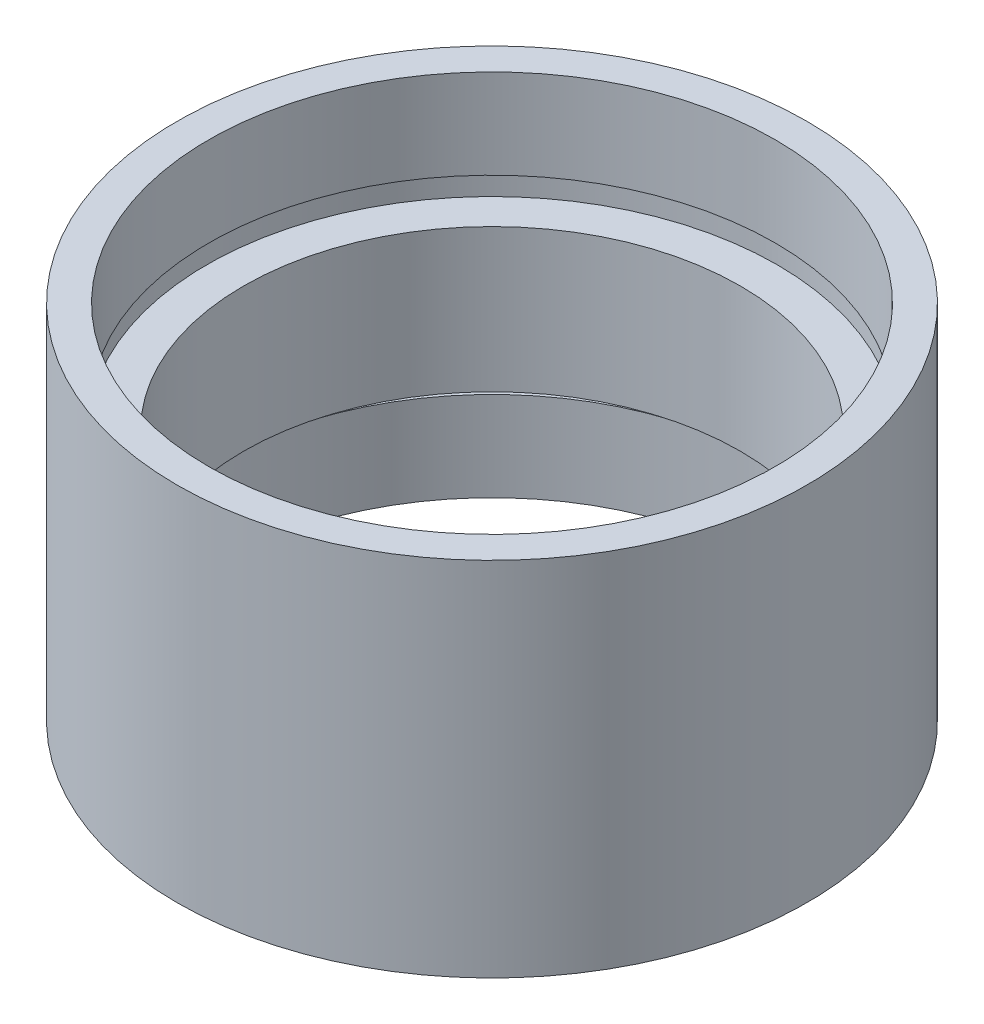
ISO-10303-21;
HEADER;
FILE_DESCRIPTION(('STEP AP214'),'2;1');
FILE_NAME('part.step','',(''),(''),'','','');
FILE_SCHEMA(('AUTOMOTIVE_DESIGN { 1 0 10303 214 1 1 1 1 }'));
ENDSEC;
DATA;
#1=APPLICATION_CONTEXT('core data for automotive mechanical design processes');
#2=APPLICATION_PROTOCOL_DEFINITION('international standard','automotive_design',2000,#1);
#3=PRODUCT_CONTEXT('',#1,'mechanical');
#4=PRODUCT('Part','Part','',(#3));
#5=PRODUCT_RELATED_PRODUCT_CATEGORY('part','',(#4));
#6=PRODUCT_DEFINITION_FORMATION('','',#4);
#7=PRODUCT_DEFINITION_CONTEXT('part definition',#1,'design');
#8=PRODUCT_DEFINITION('design','',#6,#7);
#9=PRODUCT_DEFINITION_SHAPE('','',#8);
#10=(LENGTH_UNIT() NAMED_UNIT(*) SI_UNIT(.MILLI.,.METRE.));
#11=(NAMED_UNIT(*) PLANE_ANGLE_UNIT() SI_UNIT($,.RADIAN.));
#12=(NAMED_UNIT(*) SI_UNIT($,.STERADIAN.) SOLID_ANGLE_UNIT());
#13=UNCERTAINTY_MEASURE_WITH_UNIT(LENGTH_MEASURE(1.E-05),#10,'distance_accuracy_value','');
#14=(GEOMETRIC_REPRESENTATION_CONTEXT(3) GLOBAL_UNCERTAINTY_ASSIGNED_CONTEXT((#13)) GLOBAL_UNIT_ASSIGNED_CONTEXT((#10,
#11,#12)) REPRESENTATION_CONTEXT('',''));
#15=CARTESIAN_POINT('',(0.,0.,0.));
#16=DIRECTION('',(0.,0.,1.));
#17=DIRECTION('',(1.,0.,0.));
#18=AXIS2_PLACEMENT_3D('',#15,#16,#17);
#19=CARTESIAN_POINT('',(13.75,0.,0.));
#20=DIRECTION('',(0.,1.,0.));
#21=DIRECTION('',(0.,0.,1.));
#22=AXIS2_PLACEMENT_3D('',#19,#20,#21);
#23=PLANE('',#22);
#24=CARTESIAN_POINT('',(0.,0.,0.));
#25=DIRECTION('',(0.,1.,0.));
#26=DIRECTION('',(0.,0.,1.));
#27=AXIS2_PLACEMENT_3D('',#24,#25,#26);
#28=CIRCLE('',#27,15.85);
#29=CARTESIAN_POINT('',(0.,0.,15.85));
#30=VERTEX_POINT('',#29);
#31=EDGE_CURVE('E10',#30,#30,#28,.T.);
#32=ORIENTED_EDGE('',*,*,#31,.F.);
#33=EDGE_LOOP('',(#32));
#34=FACE_BOUND('',#33,.T.);
#35=CARTESIAN_POINT('',(0.,0.,0.));
#36=DIRECTION('',(0.,1.,0.));
#37=DIRECTION('',(0.,0.,1.));
#38=AXIS2_PLACEMENT_3D('',#35,#36,#37);
#39=CIRCLE('',#38,13.75);
#40=CARTESIAN_POINT('',(0.,0.,13.75));
#41=VERTEX_POINT('',#40);
#42=EDGE_CURVE('E77',#41,#41,#39,.T.);
#43=ORIENTED_EDGE('',*,*,#42,.T.);
#44=EDGE_LOOP('',(#43));
#45=FACE_BOUND('',#44,.T.);
#46=ADVANCED_FACE('F37',(#34,#45),#23,.F.);
#47=CARTESIAN_POINT('',(0.,161.376166943427,0.));
#48=DIRECTION('',(0.,1.,0.));
#49=DIRECTION('',(0.,0.,1.));
#50=AXIS2_PLACEMENT_3D('',#47,#48,#49);
#51=CYLINDRICAL_SURFACE('',#50,15.85);
#52=CARTESIAN_POINT('',(0.,18.2,0.));
#53=DIRECTION('',(0.,1.,0.));
#54=DIRECTION('',(0.,0.,1.));
#55=AXIS2_PLACEMENT_3D('',#52,#53,#54);
#56=CIRCLE('',#55,15.85);
#57=CARTESIAN_POINT('',(0.,18.2,15.85));
#58=VERTEX_POINT('',#57);
#59=EDGE_CURVE('E43',#58,#58,#56,.T.);
#60=ORIENTED_EDGE('',*,*,#59,.F.);
#61=EDGE_LOOP('',(#60));
#62=FACE_BOUND('',#61,.T.);
#63=ORIENTED_EDGE('',*,*,#31,.T.);
#64=EDGE_LOOP('',(#63));
#65=FACE_BOUND('',#64,.T.);
#66=ADVANCED_FACE('F138',(#62,#65),#51,.T.);
#67=CARTESIAN_POINT('',(15.85,18.2,0.));
#68=DIRECTION('',(0.,-1.,0.));
#69=DIRECTION('',(0.,0.,-1.));
#70=AXIS2_PLACEMENT_3D('',#67,#68,#69);
#71=PLANE('',#70);
#72=CARTESIAN_POINT('',(0.,18.2,0.));
#73=DIRECTION('',(0.,1.,0.));
#74=DIRECTION('',(0.,0.,1.));
#75=AXIS2_PLACEMENT_3D('',#72,#73,#74);
#76=CIRCLE('',#75,14.25);
#77=CARTESIAN_POINT('',(0.,18.2,14.25));
#78=VERTEX_POINT('',#77);
#79=EDGE_CURVE('E47',#78,#78,#76,.T.);
#80=ORIENTED_EDGE('',*,*,#79,.F.);
#81=EDGE_LOOP('',(#80));
#82=FACE_BOUND('',#81,.T.);
#83=ORIENTED_EDGE('',*,*,#59,.T.);
#84=EDGE_LOOP('',(#83));
#85=FACE_BOUND('',#84,.T.);
#86=ADVANCED_FACE('F133',(#82,#85),#71,.F.);
#87=CARTESIAN_POINT('',(0.,161.376166943427,0.));
#88=DIRECTION('',(0.,1.,0.));
#89=DIRECTION('',(0.,0.,1.));
#90=AXIS2_PLACEMENT_3D('',#87,#88,#89);
#91=CYLINDRICAL_SURFACE('',#90,14.25);
#92=CARTESIAN_POINT('',(0.,13.7,0.));
#93=DIRECTION('',(0.,1.,0.));
#94=DIRECTION('',(0.,0.,1.));
#95=AXIS2_PLACEMENT_3D('',#92,#93,#94);
#96=CIRCLE('',#95,14.25);
#97=CARTESIAN_POINT('',(0.,13.7,14.25));
#98=VERTEX_POINT('',#97);
#99=EDGE_CURVE('E51',#98,#98,#96,.T.);
#100=ORIENTED_EDGE('',*,*,#99,.F.);
#101=EDGE_LOOP('',(#100));
#102=FACE_BOUND('',#101,.T.);
#103=ORIENTED_EDGE('',*,*,#79,.T.);
#104=EDGE_LOOP('',(#103));
#105=FACE_BOUND('',#104,.T.);
#106=ADVANCED_FACE('F127',(#102,#105),#91,.F.);
#107=CARTESIAN_POINT('',(14.25,13.7,0.));
#108=DIRECTION('',(0.,1.,0.));
#109=DIRECTION('',(0.,0.,1.));
#110=AXIS2_PLACEMENT_3D('',#107,#108,#109);
#111=PLANE('',#110);
#112=CARTESIAN_POINT('',(0.,13.7,0.));
#113=DIRECTION('',(0.,1.,0.));
#114=DIRECTION('',(0.,0.,1.));
#115=AXIS2_PLACEMENT_3D('',#112,#113,#114);
#116=CIRCLE('',#115,14.35);
#117=CARTESIAN_POINT('',(0.,13.7,14.35));
#118=VERTEX_POINT('',#117);
#119=EDGE_CURVE('E56',#118,#118,#116,.T.);
#120=ORIENTED_EDGE('',*,*,#119,.F.);
#121=EDGE_LOOP('',(#120));
#122=FACE_BOUND('',#121,.T.);
#123=ORIENTED_EDGE('',*,*,#99,.T.);
#124=EDGE_LOOP('',(#123));
#125=FACE_BOUND('',#124,.T.);
#126=ADVANCED_FACE('F121',(#122,#125),#111,.F.);
#127=CARTESIAN_POINT('',(0.,161.376166943427,0.));
#128=DIRECTION('',(0.,1.,0.));
#129=DIRECTION('',(0.,0.,1.));
#130=AXIS2_PLACEMENT_3D('',#127,#128,#129);
#131=CYLINDRICAL_SURFACE('',#130,14.35);
#132=CARTESIAN_POINT('',(0.,12.7,0.));
#133=DIRECTION('',(0.,1.,0.));
#134=DIRECTION('',(0.,0.,1.));
#135=AXIS2_PLACEMENT_3D('',#132,#133,#134);
#136=CIRCLE('',#135,14.35);
#137=CARTESIAN_POINT('',(0.,12.7,14.35));
#138=VERTEX_POINT('',#137);
#139=EDGE_CURVE('E59',#138,#138,#136,.T.);
#140=ORIENTED_EDGE('',*,*,#139,.F.);
#141=EDGE_LOOP('',(#140));
#142=FACE_BOUND('',#141,.T.);
#143=ORIENTED_EDGE('',*,*,#119,.T.);
#144=EDGE_LOOP('',(#143));
#145=FACE_BOUND('',#144,.T.);
#146=ADVANCED_FACE('F115',(#142,#145),#131,.F.);
#147=CARTESIAN_POINT('',(12.5,12.7,0.));
#148=DIRECTION('',(0.,-1.,0.));
#149=DIRECTION('',(0.,0.,-1.));
#150=AXIS2_PLACEMENT_3D('',#147,#148,#149);
#151=PLANE('',#150);
#152=CARTESIAN_POINT('',(0.,12.7,0.));
#153=DIRECTION('',(0.,1.,0.));
#154=DIRECTION('',(0.,0.,1.));
#155=AXIS2_PLACEMENT_3D('',#152,#153,#154);
#156=CIRCLE('',#155,12.5);
#157=CARTESIAN_POINT('',(0.,12.7,12.5));
#158=VERTEX_POINT('',#157);
#159=EDGE_CURVE('E62',#158,#158,#156,.T.);
#160=ORIENTED_EDGE('',*,*,#159,.F.);
#161=EDGE_LOOP('',(#160));
#162=FACE_BOUND('',#161,.T.);
#163=ORIENTED_EDGE('',*,*,#139,.T.);
#164=EDGE_LOOP('',(#163));
#165=FACE_BOUND('',#164,.T.);
#166=ADVANCED_FACE('F109',(#162,#165),#151,.F.);
#167=CARTESIAN_POINT('',(0.,161.376166943427,0.));
#168=DIRECTION('',(0.,1.,0.));
#169=DIRECTION('',(0.,0.,1.));
#170=AXIS2_PLACEMENT_3D('',#167,#168,#169);
#171=CYLINDRICAL_SURFACE('',#170,12.5);
#172=CARTESIAN_POINT('',(0.,5.49999999999998,0.));
#173=DIRECTION('',(0.,1.,0.));
#174=DIRECTION('',(0.,0.,1.));
#175=AXIS2_PLACEMENT_3D('',#172,#173,#174);
#176=CIRCLE('',#175,12.5);
#177=CARTESIAN_POINT('',(0.,5.49999999999998,12.5));
#178=VERTEX_POINT('',#177);
#179=EDGE_CURVE('E65',#178,#178,#176,.T.);
#180=ORIENTED_EDGE('',*,*,#179,.F.);
#181=EDGE_LOOP('',(#180));
#182=FACE_BOUND('',#181,.T.);
#183=ORIENTED_EDGE('',*,*,#159,.T.);
#184=EDGE_LOOP('',(#183));
#185=FACE_BOUND('',#184,.T.);
#186=ADVANCED_FACE('F103',(#182,#185),#171,.F.);
#187=CARTESIAN_POINT('',(12.5,5.49999999999998,0.));
#188=DIRECTION('',(0.,1.,0.));
#189=DIRECTION('',(0.,0.,1.));
#190=AXIS2_PLACEMENT_3D('',#187,#188,#189);
#191=PLANE('',#190);
#192=CARTESIAN_POINT('',(0.,5.49999999999998,0.));
#193=DIRECTION('',(0.,1.,0.));
#194=DIRECTION('',(0.,0.,1.));
#195=AXIS2_PLACEMENT_3D('',#192,#193,#194);
#196=CIRCLE('',#195,14.35);
#197=CARTESIAN_POINT('',(0.,5.49999999999998,14.35));
#198=VERTEX_POINT('',#197);
#199=EDGE_CURVE('E68',#198,#198,#196,.T.);
#200=ORIENTED_EDGE('',*,*,#199,.F.);
#201=EDGE_LOOP('',(#200));
#202=FACE_BOUND('',#201,.T.);
#203=ORIENTED_EDGE('',*,*,#179,.T.);
#204=EDGE_LOOP('',(#203));
#205=FACE_BOUND('',#204,.T.);
#206=ADVANCED_FACE('F97',(#202,#205),#191,.F.);
#207=CARTESIAN_POINT('',(0.,161.376166943427,0.));
#208=DIRECTION('',(0.,1.,0.));
#209=DIRECTION('',(0.,0.,1.));
#210=AXIS2_PLACEMENT_3D('',#207,#208,#209);
#211=CYLINDRICAL_SURFACE('',#210,14.35);
#212=CARTESIAN_POINT('',(0.,4.49999999999998,0.));
#213=DIRECTION('',(0.,1.,0.));
#214=DIRECTION('',(0.,0.,1.));
#215=AXIS2_PLACEMENT_3D('',#212,#213,#214);
#216=CIRCLE('',#215,14.35);
#217=CARTESIAN_POINT('',(0.,4.49999999999998,14.35));
#218=VERTEX_POINT('',#217);
#219=EDGE_CURVE('E71',#218,#218,#216,.T.);
#220=ORIENTED_EDGE('',*,*,#219,.F.);
#221=EDGE_LOOP('',(#220));
#222=FACE_BOUND('',#221,.T.);
#223=ORIENTED_EDGE('',*,*,#199,.T.);
#224=EDGE_LOOP('',(#223));
#225=FACE_BOUND('',#224,.T.);
#226=ADVANCED_FACE('F91',(#222,#225),#211,.F.);
#227=CARTESIAN_POINT('',(13.75,4.49999999999998,0.));
#228=DIRECTION('',(0.,-1.,0.));
#229=DIRECTION('',(0.,0.,-1.));
#230=AXIS2_PLACEMENT_3D('',#227,#228,#229);
#231=PLANE('',#230);
#232=CARTESIAN_POINT('',(0.,4.49999999999998,0.));
#233=DIRECTION('',(0.,1.,0.));
#234=DIRECTION('',(0.,0.,1.));
#235=AXIS2_PLACEMENT_3D('',#232,#233,#234);
#236=CIRCLE('',#235,13.75);
#237=CARTESIAN_POINT('',(0.,4.49999999999998,13.75));
#238=VERTEX_POINT('',#237);
#239=EDGE_CURVE('E74',#238,#238,#236,.T.);
#240=ORIENTED_EDGE('',*,*,#239,.F.);
#241=EDGE_LOOP('',(#240));
#242=FACE_BOUND('',#241,.T.);
#243=ORIENTED_EDGE('',*,*,#219,.T.);
#244=EDGE_LOOP('',(#243));
#245=FACE_BOUND('',#244,.T.);
#246=ADVANCED_FACE('F85',(#242,#245),#231,.F.);
#247=CARTESIAN_POINT('',(0.,161.376166943427,0.));
#248=DIRECTION('',(0.,1.,0.));
#249=DIRECTION('',(0.,0.,1.));
#250=AXIS2_PLACEMENT_3D('',#247,#248,#249);
#251=CYLINDRICAL_SURFACE('',#250,13.75);
#252=ORIENTED_EDGE('',*,*,#42,.F.);
#253=EDGE_LOOP('',(#252));
#254=FACE_BOUND('',#253,.T.);
#255=ORIENTED_EDGE('',*,*,#239,.T.);
#256=EDGE_LOOP('',(#255));
#257=FACE_BOUND('',#256,.T.);
#258=ADVANCED_FACE('F82',(#254,#257),#251,.F.);
#259=CLOSED_SHELL('',(#46,#66,#86,#106,#126,#146,#166,#186,#206,#226,#246,#258));
#260=MANIFOLD_SOLID_BREP('B2',#259);
#261=ADVANCED_BREP_SHAPE_REPRESENTATION('',(#18,#260),#14);
#262=SHAPE_DEFINITION_REPRESENTATION(#9,#261);
ENDSEC;
END-ISO-10303-21;
